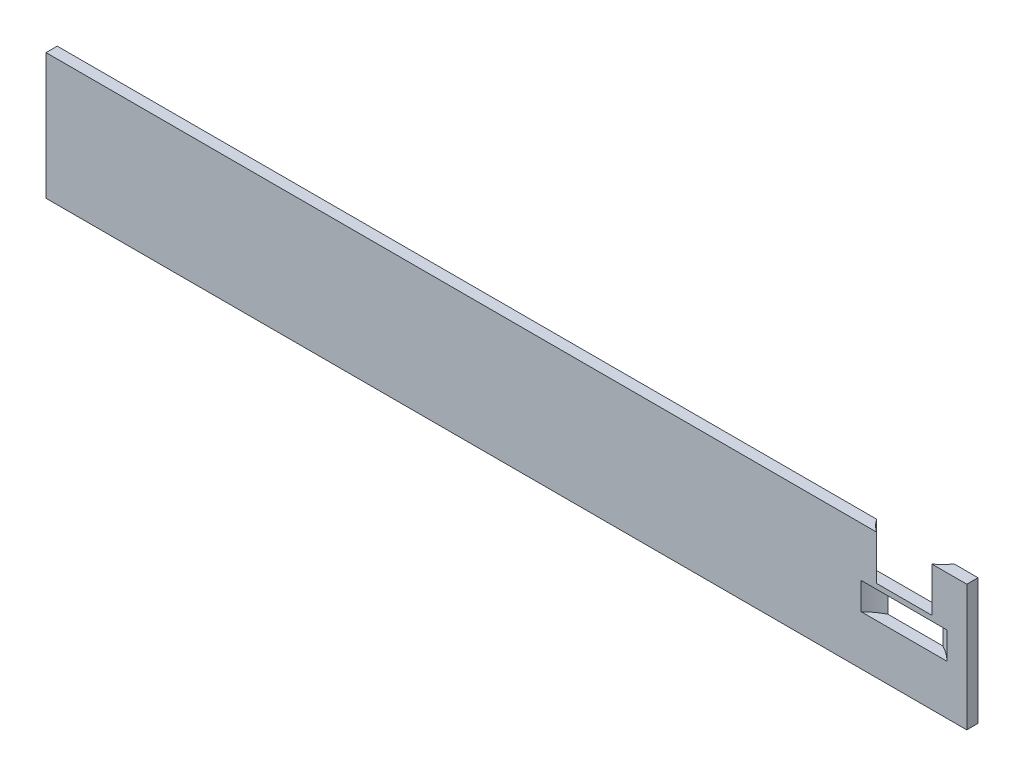
ISO-10303-21;
HEADER;
FILE_DESCRIPTION(('STEP AP214'),'2;1');
FILE_NAME('part.step','',(''),(''),'','','');
FILE_SCHEMA(('AUTOMOTIVE_DESIGN { 1 0 10303 214 1 1 1 1 }'));
ENDSEC;
DATA;
#1=APPLICATION_CONTEXT('core data for automotive mechanical design processes');
#2=APPLICATION_PROTOCOL_DEFINITION('international standard','automotive_design',2000,#1);
#3=PRODUCT_CONTEXT('',#1,'mechanical');
#4=PRODUCT('Part','Part','',(#3));
#5=PRODUCT_RELATED_PRODUCT_CATEGORY('part','',(#4));
#6=PRODUCT_DEFINITION_FORMATION('','',#4);
#7=PRODUCT_DEFINITION_CONTEXT('part definition',#1,'design');
#8=PRODUCT_DEFINITION('design','',#6,#7);
#9=PRODUCT_DEFINITION_SHAPE('','',#8);
#10=(LENGTH_UNIT() NAMED_UNIT(*) SI_UNIT(.MILLI.,.METRE.));
#11=(NAMED_UNIT(*) PLANE_ANGLE_UNIT() SI_UNIT($,.RADIAN.));
#12=(NAMED_UNIT(*) SI_UNIT($,.STERADIAN.) SOLID_ANGLE_UNIT());
#13=UNCERTAINTY_MEASURE_WITH_UNIT(LENGTH_MEASURE(1.E-05),#10,'distance_accuracy_value','');
#14=(GEOMETRIC_REPRESENTATION_CONTEXT(3) GLOBAL_UNCERTAINTY_ASSIGNED_CONTEXT((#13)) GLOBAL_UNIT_ASSIGNED_CONTEXT((#10,
#11,#12)) REPRESENTATION_CONTEXT('',''));
#15=CARTESIAN_POINT('',(0.,0.,0.));
#16=DIRECTION('',(0.,0.,1.));
#17=DIRECTION('',(1.,0.,0.));
#18=AXIS2_PLACEMENT_3D('',#15,#16,#17);
#19=CARTESIAN_POINT('',(0.,0.,12.));
#20=DIRECTION('',(0.,0.,1.));
#21=DIRECTION('',(1.,0.,0.));
#22=AXIS2_PLACEMENT_3D('',#19,#20,#21);
#23=PLANE('',#22);
#24=DIRECTION('',(0.,1.,0.));
#25=VECTOR('',#24,1.);
#26=CARTESIAN_POINT('',(-37.345995211439,87.5,12.));
#27=LINE('',#26,#25);
#28=CARTESIAN_POINT('',(-37.345995211439,87.5,12.));
#29=VERTEX_POINT('',#28);
#30=CARTESIAN_POINT('',(-37.345995211439,135.,12.));
#31=VERTEX_POINT('',#30);
#32=EDGE_CURVE('E182',#29,#31,#27,.T.);
#33=ORIENTED_EDGE('',*,*,#32,.F.);
#34=DIRECTION('',(1.,0.,0.));
#35=VECTOR('',#34,1.);
#36=CARTESIAN_POINT('',(-37.345995211439,87.5,12.));
#37=LINE('',#36,#35);
#38=CARTESIAN_POINT('',(-96.654004788561,87.5,12.));
#39=VERTEX_POINT('',#38);
#40=EDGE_CURVE('E201',#39,#29,#37,.T.);
#41=ORIENTED_EDGE('',*,*,#40,.F.);
#42=DIRECTION('',(0.,1.,0.));
#43=VECTOR('',#42,1.);
#44=CARTESIAN_POINT('',(-96.654004788561,87.5,12.));
#45=LINE('',#44,#43);
#46=CARTESIAN_POINT('',(-96.654004788561,135.,12.));
#47=VERTEX_POINT('',#46);
#48=EDGE_CURVE('E204',#39,#47,#45,.T.);
#49=ORIENTED_EDGE('',*,*,#48,.T.);
#50=DIRECTION('',(-1.,0.,0.));
#51=VECTOR('',#50,1.);
#52=CARTESIAN_POINT('',(-985.,135.,12.));
#53=LINE('',#52,#51);
#54=CARTESIAN_POINT('',(-985.,135.,12.));
#55=VERTEX_POINT('',#54);
#56=EDGE_CURVE('E186',#47,#55,#53,.T.);
#57=ORIENTED_EDGE('',*,*,#56,.T.);
#58=DIRECTION('',(0.,-1.,0.));
#59=VECTOR('',#58,1.);
#60=CARTESIAN_POINT('',(-985.,135.,12.));
#61=LINE('',#60,#59);
#62=CARTESIAN_POINT('',(-985.,0.,12.));
#63=VERTEX_POINT('',#62);
#64=EDGE_CURVE('E170',#55,#63,#61,.T.);
#65=ORIENTED_EDGE('',*,*,#64,.T.);
#66=DIRECTION('',(1.,0.,0.));
#67=VECTOR('',#66,1.);
#68=CARTESIAN_POINT('',(-985.,0.,12.));
#69=LINE('',#68,#67);
#70=CARTESIAN_POINT('',(0.,0.,12.));
#71=VERTEX_POINT('',#70);
#72=EDGE_CURVE('E190',#63,#71,#69,.T.);
#73=ORIENTED_EDGE('',*,*,#72,.T.);
#74=DIRECTION('',(0.,1.,0.));
#75=VECTOR('',#74,1.);
#76=CARTESIAN_POINT('',(0.,135.,12.));
#77=LINE('',#76,#75);
#78=CARTESIAN_POINT('',(0.,135.,12.));
#79=VERTEX_POINT('',#78);
#80=EDGE_CURVE('E187',#71,#79,#77,.T.);
#81=ORIENTED_EDGE('',*,*,#80,.T.);
#82=EDGE_CURVE('E165',#79,#31,#53,.T.);
#83=ORIENTED_EDGE('',*,*,#82,.T.);
#84=EDGE_LOOP('',(#33,#41,#49,#57,#65,#73,#81,#83));
#85=FACE_BOUND('',#84,.T.);
#86=DIRECTION('',(0.,1.,0.));
#87=VECTOR('',#86,1.);
#88=CARTESIAN_POINT('',(-21.0761499871799,53.,12.));
#89=LINE('',#88,#87);
#90=CARTESIAN_POINT('',(-21.0761499871799,53.,12.));
#91=VERTEX_POINT('',#90);
#92=CARTESIAN_POINT('',(-21.0761499871799,82.,12.));
#93=VERTEX_POINT('',#92);
#94=EDGE_CURVE('E139',#91,#93,#89,.T.);
#95=ORIENTED_EDGE('',*,*,#94,.F.);
#96=DIRECTION('',(-1.,0.,0.));
#97=VECTOR('',#96,1.);
#98=CARTESIAN_POINT('',(0.,53.,12.));
#99=LINE('',#98,#97);
#100=CARTESIAN_POINT('',(-112.92385001282,53.,12.));
#101=VERTEX_POINT('',#100);
#102=EDGE_CURVE('E235',#91,#101,#99,.T.);
#103=ORIENTED_EDGE('',*,*,#102,.T.);
#104=DIRECTION('',(0.,1.,0.));
#105=VECTOR('',#104,1.);
#106=CARTESIAN_POINT('',(-112.92385001282,53.,12.));
#107=LINE('',#106,#105);
#108=CARTESIAN_POINT('',(-112.92385001282,82.,12.));
#109=VERTEX_POINT('',#108);
#110=EDGE_CURVE('E232',#109,#101,#107,.F.);
#111=ORIENTED_EDGE('',*,*,#110,.F.);
#112=DIRECTION('',(-1.,0.,0.));
#113=VECTOR('',#112,1.);
#114=CARTESIAN_POINT('',(0.,82.,12.));
#115=LINE('',#114,#113);
#116=EDGE_CURVE('E239',#93,#109,#115,.T.);
#117=ORIENTED_EDGE('',*,*,#116,.F.);
#118=EDGE_LOOP('',(#95,#103,#111,#117));
#119=FACE_BOUND('',#118,.T.);
#120=ADVANCED_FACE('F39',(#85,#119),#23,.T.);
#121=CARTESIAN_POINT('',(0.,0.,0.));
#122=DIRECTION('',(0.,0.,1.));
#123=DIRECTION('',(1.,0.,0.));
#124=AXIS2_PLACEMENT_3D('',#121,#122,#123);
#125=PLANE('',#124);
#126=DIRECTION('',(-1.,0.,0.));
#127=VECTOR('',#126,1.);
#128=CARTESIAN_POINT('',(-25.5348338963896,87.5,0.));
#129=LINE('',#128,#127);
#130=CARTESIAN_POINT('',(-25.5348338963896,87.5,0.));
#131=VERTEX_POINT('',#130);
#132=CARTESIAN_POINT('',(-108.46516610361,87.5,0.));
#133=VERTEX_POINT('',#132);
#134=EDGE_CURVE('E224',#131,#133,#129,.T.);
#135=ORIENTED_EDGE('',*,*,#134,.F.);
#136=DIRECTION('',(0.,1.,0.));
#137=VECTOR('',#136,1.);
#138=CARTESIAN_POINT('',(-25.5348338963896,87.5,0.));
#139=LINE('',#138,#137);
#140=CARTESIAN_POINT('',(-25.5348338963896,135.,0.));
#141=VERTEX_POINT('',#140);
#142=EDGE_CURVE('E196',#131,#141,#139,.T.);
#143=ORIENTED_EDGE('',*,*,#142,.T.);
#144=DIRECTION('',(-1.,0.,0.));
#145=VECTOR('',#144,1.);
#146=CARTESIAN_POINT('',(-985.,135.,0.));
#147=LINE('',#146,#145);
#148=CARTESIAN_POINT('',(0.,135.,0.));
#149=VERTEX_POINT('',#148);
#150=EDGE_CURVE('E166',#149,#141,#147,.T.);
#151=ORIENTED_EDGE('',*,*,#150,.F.);
#152=DIRECTION('',(0.,1.,0.));
#153=VECTOR('',#152,1.);
#154=CARTESIAN_POINT('',(0.,135.,0.));
#155=LINE('',#154,#153);
#156=CARTESIAN_POINT('',(0.,0.,0.));
#157=VERTEX_POINT('',#156);
#158=EDGE_CURVE('E172',#157,#149,#155,.T.);
#159=ORIENTED_EDGE('',*,*,#158,.F.);
#160=DIRECTION('',(1.,0.,0.));
#161=VECTOR('',#160,1.);
#162=CARTESIAN_POINT('',(-985.,0.,0.));
#163=LINE('',#162,#161);
#164=CARTESIAN_POINT('',(-985.,0.,0.));
#165=VERTEX_POINT('',#164);
#166=EDGE_CURVE('E175',#165,#157,#163,.T.);
#167=ORIENTED_EDGE('',*,*,#166,.F.);
#168=DIRECTION('',(0.,-1.,0.));
#169=VECTOR('',#168,1.);
#170=CARTESIAN_POINT('',(-985.,135.,0.));
#171=LINE('',#170,#169);
#172=CARTESIAN_POINT('',(-985.,135.,0.));
#173=VERTEX_POINT('',#172);
#174=EDGE_CURVE('E178',#173,#165,#171,.T.);
#175=ORIENTED_EDGE('',*,*,#174,.F.);
#176=CARTESIAN_POINT('',(-108.46516610361,135.,0.));
#177=VERTEX_POINT('',#176);
#178=EDGE_CURVE('E171',#177,#173,#147,.T.);
#179=ORIENTED_EDGE('',*,*,#178,.F.);
#180=DIRECTION('',(0.,1.,0.));
#181=VECTOR('',#180,1.);
#182=CARTESIAN_POINT('',(-108.46516610361,87.5,0.));
#183=LINE('',#182,#181);
#184=EDGE_CURVE('E200',#133,#177,#183,.T.);
#185=ORIENTED_EDGE('',*,*,#184,.F.);
#186=EDGE_LOOP('',(#135,#143,#151,#159,#167,#175,#179,#185));
#187=FACE_BOUND('',#186,.T.);
#188=DIRECTION('',(-1.,0.,0.));
#189=VECTOR('',#188,1.);
#190=CARTESIAN_POINT('',(0.,53.,0.));
#191=LINE('',#190,#189);
#192=CARTESIAN_POINT('',(-37.6571984977576,53.,0.));
#193=VERTEX_POINT('',#192);
#194=CARTESIAN_POINT('',(-96.3428015022424,53.,0.));
#195=VERTEX_POINT('',#194);
#196=EDGE_CURVE('E11',#193,#195,#191,.T.);
#197=ORIENTED_EDGE('',*,*,#196,.F.);
#198=DIRECTION('',(0.,1.,0.));
#199=VECTOR('',#198,1.);
#200=CARTESIAN_POINT('',(-37.6571984977576,53.,0.));
#201=LINE('',#200,#199);
#202=CARTESIAN_POINT('',(-37.6571984977576,82.,0.));
#203=VERTEX_POINT('',#202);
#204=EDGE_CURVE('E48',#193,#203,#201,.T.);
#205=ORIENTED_EDGE('',*,*,#204,.T.);
#206=DIRECTION('',(-1.,0.,0.));
#207=VECTOR('',#206,1.);
#208=CARTESIAN_POINT('',(0.,82.,0.));
#209=LINE('',#208,#207);
#210=CARTESIAN_POINT('',(-96.3428015022424,82.,0.));
#211=VERTEX_POINT('',#210);
#212=EDGE_CURVE('E125',#203,#211,#209,.T.);
#213=ORIENTED_EDGE('',*,*,#212,.T.);
#214=DIRECTION('',(0.,1.,0.));
#215=VECTOR('',#214,1.);
#216=CARTESIAN_POINT('',(-96.3428015022424,53.,0.));
#217=LINE('',#216,#215);
#218=EDGE_CURVE('E131',#211,#195,#217,.F.);
#219=ORIENTED_EDGE('',*,*,#218,.T.);
#220=EDGE_LOOP('',(#197,#205,#213,#219));
#221=FACE_BOUND('',#220,.T.);
#222=ADVANCED_FACE('F145',(#187,#221),#125,.F.);
#223=CARTESIAN_POINT('',(-985.,135.,12.));
#224=DIRECTION('',(0.,-1.,0.));
#225=DIRECTION('',(0.,0.,-1.));
#226=AXIS2_PLACEMENT_3D('',#223,#224,#225);
#227=PLANE('',#226);
#228=ORIENTED_EDGE('',*,*,#150,.T.);
#229=CARTESIAN_POINT('',(-67.,135.,-29.));
#230=DIRECTION('',(0.,1.,0.));
#231=DIRECTION('',(0.,0.,1.));
#232=AXIS2_PLACEMENT_3D('',#229,#230,#231);
#233=CIRCLE('',#232,50.6);
#234=EDGE_CURVE('E214',#31,#141,#233,.T.);
#235=ORIENTED_EDGE('',*,*,#234,.F.);
#236=ORIENTED_EDGE('',*,*,#82,.F.);
#237=DIRECTION('',(0.,0.,-1.));
#238=VECTOR('',#237,1.);
#239=CARTESIAN_POINT('',(0.,135.,12.));
#240=LINE('',#239,#238);
#241=EDGE_CURVE('E157',#79,#149,#240,.T.);
#242=ORIENTED_EDGE('',*,*,#241,.T.);
#243=EDGE_LOOP('',(#228,#235,#236,#242));
#244=FACE_BOUND('',#243,.T.);
#245=ADVANCED_FACE('F270',(#244),#227,.F.);
#246=CARTESIAN_POINT('',(-985.,135.,12.));
#247=DIRECTION('',(1.,0.,0.));
#248=DIRECTION('',(0.,0.,-1.));
#249=AXIS2_PLACEMENT_3D('',#246,#247,#248);
#250=PLANE('',#249);
#251=ORIENTED_EDGE('',*,*,#174,.T.);
#252=DIRECTION('',(0.,0.,-1.));
#253=VECTOR('',#252,1.);
#254=CARTESIAN_POINT('',(-985.,0.,12.));
#255=LINE('',#254,#253);
#256=EDGE_CURVE('E132',#63,#165,#255,.T.);
#257=ORIENTED_EDGE('',*,*,#256,.F.);
#258=ORIENTED_EDGE('',*,*,#64,.F.);
#259=DIRECTION('',(0.,0.,-1.));
#260=VECTOR('',#259,1.);
#261=CARTESIAN_POINT('',(-985.,135.,12.));
#262=LINE('',#261,#260);
#263=EDGE_CURVE('E161',#55,#173,#262,.T.);
#264=ORIENTED_EDGE('',*,*,#263,.T.);
#265=EDGE_LOOP('',(#251,#257,#258,#264));
#266=FACE_BOUND('',#265,.T.);
#267=ADVANCED_FACE('F41',(#266),#250,.F.);
#268=CARTESIAN_POINT('',(-985.,0.,12.));
#269=DIRECTION('',(0.,1.,0.));
#270=DIRECTION('',(0.,0.,1.));
#271=AXIS2_PLACEMENT_3D('',#268,#269,#270);
#272=PLANE('',#271);
#273=ORIENTED_EDGE('',*,*,#166,.T.);
#274=DIRECTION('',(0.,0.,-1.));
#275=VECTOR('',#274,1.);
#276=CARTESIAN_POINT('',(0.,0.,12.));
#277=LINE('',#276,#275);
#278=EDGE_CURVE('E153',#71,#157,#277,.T.);
#279=ORIENTED_EDGE('',*,*,#278,.F.);
#280=ORIENTED_EDGE('',*,*,#72,.F.);
#281=ORIENTED_EDGE('',*,*,#256,.T.);
#282=EDGE_LOOP('',(#273,#279,#280,#281));
#283=FACE_BOUND('',#282,.T.);
#284=ADVANCED_FACE('F284',(#283),#272,.F.);
#285=CARTESIAN_POINT('',(0.,135.,12.));
#286=DIRECTION('',(-1.,0.,0.));
#287=DIRECTION('',(0.,0.,1.));
#288=AXIS2_PLACEMENT_3D('',#285,#286,#287);
#289=PLANE('',#288);
#290=ORIENTED_EDGE('',*,*,#158,.T.);
#291=ORIENTED_EDGE('',*,*,#241,.F.);
#292=ORIENTED_EDGE('',*,*,#80,.F.);
#293=ORIENTED_EDGE('',*,*,#278,.T.);
#294=EDGE_LOOP('',(#290,#291,#292,#293));
#295=FACE_BOUND('',#294,.T.);
#296=ADVANCED_FACE('F281',(#295),#289,.F.);
#297=ORIENTED_EDGE('',*,*,#56,.F.);
#298=CARTESIAN_POINT('',(-67.,135.,-29.));
#299=DIRECTION('',(0.,1.,0.));
#300=DIRECTION('',(0.,0.,1.));
#301=AXIS2_PLACEMENT_3D('',#298,#299,#300);
#302=CIRCLE('',#301,50.6);
#303=EDGE_CURVE('E210',#177,#47,#302,.T.);
#304=ORIENTED_EDGE('',*,*,#303,.F.);
#305=ORIENTED_EDGE('',*,*,#178,.T.);
#306=ORIENTED_EDGE('',*,*,#263,.F.);
#307=EDGE_LOOP('',(#297,#304,#305,#306));
#308=FACE_BOUND('',#307,.T.);
#309=ADVANCED_FACE('F278',(#308),#227,.F.);
#310=CARTESIAN_POINT('',(-67.,87.5,-29.));
#311=DIRECTION('',(0.,1.,0.));
#312=DIRECTION('',(0.,0.,1.));
#313=AXIS2_PLACEMENT_3D('',#310,#311,#312);
#314=CYLINDRICAL_SURFACE('',#313,50.6);
#315=ORIENTED_EDGE('',*,*,#234,.T.);
#316=ORIENTED_EDGE('',*,*,#142,.F.);
#317=CARTESIAN_POINT('',(-67.,87.5,-29.));
#318=DIRECTION('',(0.,1.,0.));
#319=DIRECTION('',(0.,0.,1.));
#320=AXIS2_PLACEMENT_3D('',#317,#318,#319);
#321=CIRCLE('',#320,50.6);
#322=EDGE_CURVE('E213',#29,#131,#321,.T.);
#323=ORIENTED_EDGE('',*,*,#322,.F.);
#324=ORIENTED_EDGE('',*,*,#32,.T.);
#325=EDGE_LOOP('',(#315,#316,#323,#324));
#326=FACE_BOUND('',#325,.T.);
#327=ADVANCED_FACE('F275',(#326),#314,.F.);
#328=CARTESIAN_POINT('',(-67.,87.5,-29.));
#329=DIRECTION('',(0.,1.,0.));
#330=DIRECTION('',(0.,0.,1.));
#331=AXIS2_PLACEMENT_3D('',#328,#329,#330);
#332=CYLINDRICAL_SURFACE('',#331,50.6);
#333=ORIENTED_EDGE('',*,*,#303,.T.);
#334=ORIENTED_EDGE('',*,*,#48,.F.);
#335=CARTESIAN_POINT('',(-67.,87.5,-29.));
#336=DIRECTION('',(0.,1.,0.));
#337=DIRECTION('',(0.,0.,1.));
#338=AXIS2_PLACEMENT_3D('',#335,#336,#337);
#339=CIRCLE('',#338,50.6);
#340=EDGE_CURVE('E220',#133,#39,#339,.T.);
#341=ORIENTED_EDGE('',*,*,#340,.F.);
#342=ORIENTED_EDGE('',*,*,#184,.T.);
#343=EDGE_LOOP('',(#333,#334,#341,#342));
#344=FACE_BOUND('',#343,.T.);
#345=ADVANCED_FACE('F314',(#344),#332,.F.);
#346=CARTESIAN_POINT('',(-67.,87.5,-29.));
#347=DIRECTION('',(0.,1.,0.));
#348=DIRECTION('',(0.,0.,1.));
#349=AXIS2_PLACEMENT_3D('',#346,#347,#348);
#350=PLANE('',#349);
#351=ORIENTED_EDGE('',*,*,#322,.T.);
#352=ORIENTED_EDGE('',*,*,#134,.T.);
#353=ORIENTED_EDGE('',*,*,#340,.T.);
#354=ORIENTED_EDGE('',*,*,#40,.T.);
#355=EDGE_LOOP('',(#351,#352,#353,#354));
#356=FACE_BOUND('',#355,.T.);
#357=ADVANCED_FACE('F261',(#356),#350,.T.);
#358=CARTESIAN_POINT('',(-67.,53.,58.));
#359=DIRECTION('',(0.,1.,0.));
#360=DIRECTION('',(0.,0.,1.));
#361=AXIS2_PLACEMENT_3D('',#358,#359,#360);
#362=CYLINDRICAL_SURFACE('',#361,65.);
#363=ORIENTED_EDGE('',*,*,#94,.T.);
#364=CARTESIAN_POINT('',(-67.,82.,58.));
#365=DIRECTION('',(0.,1.,0.));
#366=DIRECTION('',(0.,0.,1.));
#367=AXIS2_PLACEMENT_3D('',#364,#365,#366);
#368=CIRCLE('',#367,65.);
#369=EDGE_CURVE('E55',#93,#203,#368,.T.);
#370=ORIENTED_EDGE('',*,*,#369,.T.);
#371=ORIENTED_EDGE('',*,*,#204,.F.);
#372=CARTESIAN_POINT('',(-67.,53.,58.));
#373=DIRECTION('',(0.,1.,0.));
#374=DIRECTION('',(0.,0.,1.));
#375=AXIS2_PLACEMENT_3D('',#372,#373,#374);
#376=CIRCLE('',#375,65.);
#377=EDGE_CURVE('E241',#91,#193,#376,.T.);
#378=ORIENTED_EDGE('',*,*,#377,.F.);
#379=EDGE_LOOP('',(#363,#370,#371,#378));
#380=FACE_BOUND('',#379,.T.);
#381=ADVANCED_FACE('F135',(#380),#362,.F.);
#382=ORIENTED_EDGE('',*,*,#110,.T.);
#383=EDGE_CURVE('E142',#195,#101,#376,.T.);
#384=ORIENTED_EDGE('',*,*,#383,.F.);
#385=ORIENTED_EDGE('',*,*,#218,.F.);
#386=EDGE_CURVE('E60',#211,#109,#368,.T.);
#387=ORIENTED_EDGE('',*,*,#386,.T.);
#388=EDGE_LOOP('',(#382,#384,#385,#387));
#389=FACE_BOUND('',#388,.T.);
#390=ADVANCED_FACE('F252',(#389),#362,.F.);
#391=CARTESIAN_POINT('',(-67.,53.,58.));
#392=DIRECTION('',(0.,1.,0.));
#393=DIRECTION('',(0.,0.,1.));
#394=AXIS2_PLACEMENT_3D('',#391,#392,#393);
#395=PLANE('',#394);
#396=ORIENTED_EDGE('',*,*,#377,.T.);
#397=ORIENTED_EDGE('',*,*,#196,.T.);
#398=ORIENTED_EDGE('',*,*,#383,.T.);
#399=ORIENTED_EDGE('',*,*,#102,.F.);
#400=EDGE_LOOP('',(#396,#397,#398,#399));
#401=FACE_BOUND('',#400,.T.);
#402=ADVANCED_FACE('F248',(#401),#395,.T.);
#403=CARTESIAN_POINT('',(-67.,82.,58.));
#404=DIRECTION('',(0.,1.,0.));
#405=DIRECTION('',(0.,0.,1.));
#406=AXIS2_PLACEMENT_3D('',#403,#404,#405);
#407=PLANE('',#406);
#408=ORIENTED_EDGE('',*,*,#116,.T.);
#409=ORIENTED_EDGE('',*,*,#386,.F.);
#410=ORIENTED_EDGE('',*,*,#212,.F.);
#411=ORIENTED_EDGE('',*,*,#369,.F.);
#412=EDGE_LOOP('',(#408,#409,#410,#411));
#413=FACE_BOUND('',#412,.T.);
#414=ADVANCED_FACE('F126',(#413),#407,.F.);
#415=CLOSED_SHELL('',(#120,#222,#245,#267,#284,#296,#309,#327,#345,#357,#381,#390,#402,#414));
#416=MANIFOLD_SOLID_BREP('B2',#415);
#417=ADVANCED_BREP_SHAPE_REPRESENTATION('',(#18,#416),#14);
#418=SHAPE_DEFINITION_REPRESENTATION(#9,#417);
ENDSEC;
END-ISO-10303-21;
